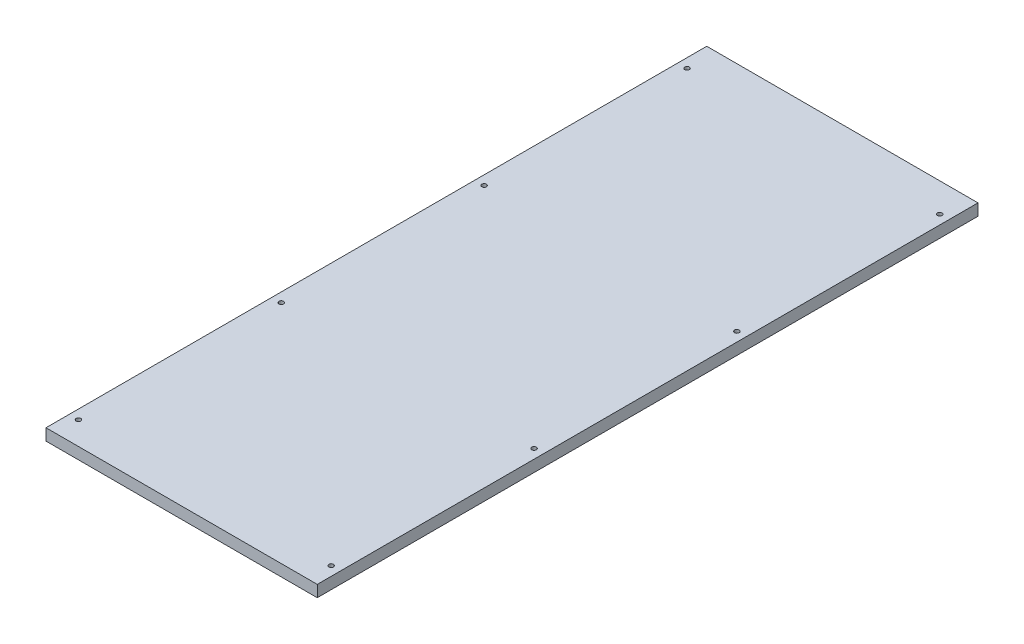
ISO-10303-21;
HEADER;
FILE_DESCRIPTION(('STEP AP214'),'2;1');
FILE_NAME('part.step','',(''),(''),'','','');
FILE_SCHEMA(('AUTOMOTIVE_DESIGN { 1 0 10303 214 1 1 1 1 }'));
ENDSEC;
DATA;
#1=APPLICATION_CONTEXT('core data for automotive mechanical design processes');
#2=APPLICATION_PROTOCOL_DEFINITION('international standard','automotive_design',2000,#1);
#3=PRODUCT_CONTEXT('',#1,'mechanical');
#4=PRODUCT('Part','Part','',(#3));
#5=PRODUCT_RELATED_PRODUCT_CATEGORY('part','',(#4));
#6=PRODUCT_DEFINITION_FORMATION('','',#4);
#7=PRODUCT_DEFINITION_CONTEXT('part definition',#1,'design');
#8=PRODUCT_DEFINITION('design','',#6,#7);
#9=PRODUCT_DEFINITION_SHAPE('','',#8);
#10=(LENGTH_UNIT() NAMED_UNIT(*) SI_UNIT(.MILLI.,.METRE.));
#11=(NAMED_UNIT(*) PLANE_ANGLE_UNIT() SI_UNIT($,.RADIAN.));
#12=(NAMED_UNIT(*) SI_UNIT($,.STERADIAN.) SOLID_ANGLE_UNIT());
#13=UNCERTAINTY_MEASURE_WITH_UNIT(LENGTH_MEASURE(1.E-05),#10,'distance_accuracy_value','');
#14=(GEOMETRIC_REPRESENTATION_CONTEXT(3) GLOBAL_UNCERTAINTY_ASSIGNED_CONTEXT((#13)) GLOBAL_UNIT_ASSIGNED_CONTEXT((#10,
#11,#12)) REPRESENTATION_CONTEXT('',''));
#15=CARTESIAN_POINT('',(0.,0.,0.));
#16=DIRECTION('',(0.,0.,1.));
#17=DIRECTION('',(1.,0.,0.));
#18=AXIS2_PLACEMENT_3D('',#15,#16,#17);
#19=CARTESIAN_POINT('',(0.,10.,0.));
#20=DIRECTION('',(0.,1.,0.));
#21=DIRECTION('',(0.,0.,1.));
#22=AXIS2_PLACEMENT_3D('',#19,#20,#21);
#23=PLANE('',#22);
#24=CARTESIAN_POINT('',(-109.000000000002,10.,-85.));
#25=DIRECTION('',(0.,1.,0.));
#26=DIRECTION('',(0.,0.,-1.));
#27=AXIS2_PLACEMENT_3D('',#24,#25,#26);
#28=CIRCLE('',#27,2.);
#29=CARTESIAN_POINT('',(-109.000000000002,10.,-87.));
#30=VERTEX_POINT('',#29);
#31=EDGE_CURVE('E145',#30,#30,#28,.T.);
#32=ORIENTED_EDGE('',*,*,#31,.F.);
#33=EDGE_LOOP('',(#32));
#34=FACE_BOUND('',#33,.T.);
#35=CARTESIAN_POINT('',(-109.000000000005,10.,265.));
#36=DIRECTION('',(0.,1.,0.));
#37=DIRECTION('',(0.,0.,-1.));
#38=AXIS2_PLACEMENT_3D('',#35,#36,#37);
#39=CIRCLE('',#38,2.);
#40=CARTESIAN_POINT('',(-109.000000000005,10.,263.));
#41=VERTEX_POINT('',#40);
#42=EDGE_CURVE('E133',#41,#41,#39,.T.);
#43=ORIENTED_EDGE('',*,*,#42,.F.);
#44=EDGE_LOOP('',(#43));
#45=FACE_BOUND('',#44,.T.);
#46=CARTESIAN_POINT('',(109.000000000004,10.,90.));
#47=DIRECTION('',(0.,1.,0.));
#48=DIRECTION('',(0.,0.,1.));
#49=AXIS2_PLACEMENT_3D('',#46,#47,#48);
#50=CIRCLE('',#49,2.);
#51=CARTESIAN_POINT('',(109.000000000004,10.,92.));
#52=VERTEX_POINT('',#51);
#53=EDGE_CURVE('E121',#52,#52,#50,.T.);
#54=ORIENTED_EDGE('',*,*,#53,.F.);
#55=EDGE_LOOP('',(#54));
#56=FACE_BOUND('',#55,.T.);
#57=CARTESIAN_POINT('',(109.,10.,-260.));
#58=DIRECTION('',(0.,1.,0.));
#59=DIRECTION('',(0.,0.,1.));
#60=AXIS2_PLACEMENT_3D('',#57,#58,#59);
#61=CIRCLE('',#60,2.);
#62=CARTESIAN_POINT('',(109.,10.,-258.));
#63=VERTEX_POINT('',#62);
#64=EDGE_CURVE('E100',#63,#63,#61,.T.);
#65=ORIENTED_EDGE('',*,*,#64,.F.);
#66=EDGE_LOOP('',(#65));
#67=FACE_BOUND('',#66,.T.);
#68=DIRECTION('',(0.,0.,1.));
#69=VECTOR('',#68,1.);
#70=CARTESIAN_POINT('',(-117.,10.,285.));
#71=LINE('',#70,#69);
#72=CARTESIAN_POINT('',(-117.,10.,-285.));
#73=VERTEX_POINT('',#72);
#74=CARTESIAN_POINT('',(-117.,10.,285.));
#75=VERTEX_POINT('',#74);
#76=EDGE_CURVE('E85',#73,#75,#71,.T.);
#77=ORIENTED_EDGE('',*,*,#76,.T.);
#78=DIRECTION('',(1.,0.,0.));
#79=VECTOR('',#78,1.);
#80=CARTESIAN_POINT('',(117.,10.,285.));
#81=LINE('',#80,#79);
#82=CARTESIAN_POINT('',(117.,10.,285.));
#83=VERTEX_POINT('',#82);
#84=EDGE_CURVE('E80',#75,#83,#81,.T.);
#85=ORIENTED_EDGE('',*,*,#84,.T.);
#86=DIRECTION('',(0.,0.,-1.));
#87=VECTOR('',#86,1.);
#88=CARTESIAN_POINT('',(117.,10.,285.));
#89=LINE('',#88,#87);
#90=CARTESIAN_POINT('',(117.,10.,-285.));
#91=VERTEX_POINT('',#90);
#92=EDGE_CURVE('E83',#83,#91,#89,.T.);
#93=ORIENTED_EDGE('',*,*,#92,.T.);
#94=DIRECTION('',(-1.,0.,0.));
#95=VECTOR('',#94,1.);
#96=CARTESIAN_POINT('',(117.,10.,-285.));
#97=LINE('',#96,#95);
#98=EDGE_CURVE('E50',#91,#73,#97,.T.);
#99=ORIENTED_EDGE('',*,*,#98,.T.);
#100=EDGE_LOOP('',(#77,#85,#93,#99));
#101=FACE_BOUND('',#100,.T.);
#102=CARTESIAN_POINT('',(109.000000000002,10.,-85.));
#103=DIRECTION('',(0.,1.,0.));
#104=DIRECTION('',(0.,0.,1.));
#105=AXIS2_PLACEMENT_3D('',#102,#103,#104);
#106=CIRCLE('',#105,2.);
#107=CARTESIAN_POINT('',(109.000000000002,10.,-83.));
#108=VERTEX_POINT('',#107);
#109=EDGE_CURVE('E115',#108,#108,#106,.T.);
#110=ORIENTED_EDGE('',*,*,#109,.F.);
#111=EDGE_LOOP('',(#110));
#112=FACE_BOUND('',#111,.T.);
#113=CARTESIAN_POINT('',(109.000000000005,10.,265.));
#114=DIRECTION('',(0.,1.,0.));
#115=DIRECTION('',(0.,0.,1.));
#116=AXIS2_PLACEMENT_3D('',#113,#114,#115);
#117=CIRCLE('',#116,2.);
#118=CARTESIAN_POINT('',(109.000000000005,10.,267.));
#119=VERTEX_POINT('',#118);
#120=EDGE_CURVE('E127',#119,#119,#117,.T.);
#121=ORIENTED_EDGE('',*,*,#120,.F.);
#122=EDGE_LOOP('',(#121));
#123=FACE_BOUND('',#122,.T.);
#124=CARTESIAN_POINT('',(-109.000000000004,10.,90.));
#125=DIRECTION('',(0.,1.,0.));
#126=DIRECTION('',(0.,0.,-1.));
#127=AXIS2_PLACEMENT_3D('',#124,#125,#126);
#128=CIRCLE('',#127,2.);
#129=CARTESIAN_POINT('',(-109.000000000004,10.,88.));
#130=VERTEX_POINT('',#129);
#131=EDGE_CURVE('E139',#130,#130,#128,.T.);
#132=ORIENTED_EDGE('',*,*,#131,.F.);
#133=EDGE_LOOP('',(#132));
#134=FACE_BOUND('',#133,.T.);
#135=CARTESIAN_POINT('',(-109.,10.,-260.));
#136=DIRECTION('',(0.,1.,0.));
#137=DIRECTION('',(0.,0.,-1.));
#138=AXIS2_PLACEMENT_3D('',#135,#136,#137);
#139=CIRCLE('',#138,2.);
#140=CARTESIAN_POINT('',(-109.,10.,-262.));
#141=VERTEX_POINT('',#140);
#142=EDGE_CURVE('E151',#141,#141,#139,.T.);
#143=ORIENTED_EDGE('',*,*,#142,.F.);
#144=EDGE_LOOP('',(#143));
#145=FACE_BOUND('',#144,.T.);
#146=ADVANCED_FACE('F33',(#34,#45,#56,#67,#101,#112,#123,#134,#145),#23,.T.);
#147=CARTESIAN_POINT('',(0.,0.,0.));
#148=DIRECTION('',(0.,1.,0.));
#149=DIRECTION('',(0.,0.,1.));
#150=AXIS2_PLACEMENT_3D('',#147,#148,#149);
#151=PLANE('',#150);
#152=DIRECTION('',(0.,0.,1.));
#153=VECTOR('',#152,1.);
#154=CARTESIAN_POINT('',(-117.,0.,285.));
#155=LINE('',#154,#153);
#156=CARTESIAN_POINT('',(-117.,0.,-285.));
#157=VERTEX_POINT('',#156);
#158=CARTESIAN_POINT('',(-117.,0.,285.));
#159=VERTEX_POINT('',#158);
#160=EDGE_CURVE('E97',#157,#159,#155,.T.);
#161=ORIENTED_EDGE('',*,*,#160,.F.);
#162=DIRECTION('',(-1.,0.,0.));
#163=VECTOR('',#162,1.);
#164=CARTESIAN_POINT('',(117.,0.,-285.));
#165=LINE('',#164,#163);
#166=CARTESIAN_POINT('',(117.,0.,-285.));
#167=VERTEX_POINT('',#166);
#168=EDGE_CURVE('E73',#167,#157,#165,.T.);
#169=ORIENTED_EDGE('',*,*,#168,.F.);
#170=DIRECTION('',(0.,0.,-1.));
#171=VECTOR('',#170,1.);
#172=CARTESIAN_POINT('',(117.,0.,285.));
#173=LINE('',#172,#171);
#174=CARTESIAN_POINT('',(117.,0.,285.));
#175=VERTEX_POINT('',#174);
#176=EDGE_CURVE('E67',#175,#167,#173,.T.);
#177=ORIENTED_EDGE('',*,*,#176,.F.);
#178=DIRECTION('',(1.,0.,0.));
#179=VECTOR('',#178,1.);
#180=CARTESIAN_POINT('',(117.,0.,285.));
#181=LINE('',#180,#179);
#182=EDGE_CURVE('E89',#159,#175,#181,.T.);
#183=ORIENTED_EDGE('',*,*,#182,.F.);
#184=EDGE_LOOP('',(#161,#169,#177,#183));
#185=FACE_BOUND('',#184,.T.);
#186=CARTESIAN_POINT('',(109.,0.,-260.));
#187=DIRECTION('',(0.,1.,0.));
#188=DIRECTION('',(0.,0.,1.));
#189=AXIS2_PLACEMENT_3D('',#186,#187,#188);
#190=CIRCLE('',#189,2.);
#191=CARTESIAN_POINT('',(109.,0.,-258.));
#192=VERTEX_POINT('',#191);
#193=EDGE_CURVE('E112',#192,#192,#190,.T.);
#194=ORIENTED_EDGE('',*,*,#193,.T.);
#195=EDGE_LOOP('',(#194));
#196=FACE_BOUND('',#195,.T.);
#197=CARTESIAN_POINT('',(109.000000000002,0.,-85.));
#198=DIRECTION('',(0.,1.,0.));
#199=DIRECTION('',(0.,0.,1.));
#200=AXIS2_PLACEMENT_3D('',#197,#198,#199);
#201=CIRCLE('',#200,2.);
#202=CARTESIAN_POINT('',(109.000000000002,0.,-83.));
#203=VERTEX_POINT('',#202);
#204=EDGE_CURVE('E118',#203,#203,#201,.T.);
#205=ORIENTED_EDGE('',*,*,#204,.T.);
#206=EDGE_LOOP('',(#205));
#207=FACE_BOUND('',#206,.T.);
#208=CARTESIAN_POINT('',(109.000000000004,0.,90.));
#209=DIRECTION('',(0.,1.,0.));
#210=DIRECTION('',(0.,0.,1.));
#211=AXIS2_PLACEMENT_3D('',#208,#209,#210);
#212=CIRCLE('',#211,2.);
#213=CARTESIAN_POINT('',(109.000000000004,0.,92.));
#214=VERTEX_POINT('',#213);
#215=EDGE_CURVE('E124',#214,#214,#212,.T.);
#216=ORIENTED_EDGE('',*,*,#215,.T.);
#217=EDGE_LOOP('',(#216));
#218=FACE_BOUND('',#217,.T.);
#219=CARTESIAN_POINT('',(109.000000000005,0.,265.));
#220=DIRECTION('',(0.,1.,0.));
#221=DIRECTION('',(0.,0.,1.));
#222=AXIS2_PLACEMENT_3D('',#219,#220,#221);
#223=CIRCLE('',#222,2.);
#224=CARTESIAN_POINT('',(109.000000000005,0.,267.));
#225=VERTEX_POINT('',#224);
#226=EDGE_CURVE('E130',#225,#225,#223,.T.);
#227=ORIENTED_EDGE('',*,*,#226,.T.);
#228=EDGE_LOOP('',(#227));
#229=FACE_BOUND('',#228,.T.);
#230=CARTESIAN_POINT('',(-109.000000000005,0.,265.));
#231=DIRECTION('',(0.,1.,0.));
#232=DIRECTION('',(0.,0.,-1.));
#233=AXIS2_PLACEMENT_3D('',#230,#231,#232);
#234=CIRCLE('',#233,2.);
#235=CARTESIAN_POINT('',(-109.000000000005,0.,263.));
#236=VERTEX_POINT('',#235);
#237=EDGE_CURVE('E136',#236,#236,#234,.T.);
#238=ORIENTED_EDGE('',*,*,#237,.T.);
#239=EDGE_LOOP('',(#238));
#240=FACE_BOUND('',#239,.T.);
#241=CARTESIAN_POINT('',(-109.000000000004,0.,90.));
#242=DIRECTION('',(0.,1.,0.));
#243=DIRECTION('',(0.,0.,-1.));
#244=AXIS2_PLACEMENT_3D('',#241,#242,#243);
#245=CIRCLE('',#244,2.);
#246=CARTESIAN_POINT('',(-109.000000000004,0.,88.));
#247=VERTEX_POINT('',#246);
#248=EDGE_CURVE('E142',#247,#247,#245,.T.);
#249=ORIENTED_EDGE('',*,*,#248,.T.);
#250=EDGE_LOOP('',(#249));
#251=FACE_BOUND('',#250,.T.);
#252=CARTESIAN_POINT('',(-109.000000000002,0.,-85.));
#253=DIRECTION('',(0.,1.,0.));
#254=DIRECTION('',(0.,0.,-1.));
#255=AXIS2_PLACEMENT_3D('',#252,#253,#254);
#256=CIRCLE('',#255,2.);
#257=CARTESIAN_POINT('',(-109.000000000002,0.,-87.));
#258=VERTEX_POINT('',#257);
#259=EDGE_CURVE('E148',#258,#258,#256,.T.);
#260=ORIENTED_EDGE('',*,*,#259,.T.);
#261=EDGE_LOOP('',(#260));
#262=FACE_BOUND('',#261,.T.);
#263=CARTESIAN_POINT('',(-109.,0.,-260.));
#264=DIRECTION('',(0.,1.,0.));
#265=DIRECTION('',(0.,0.,-1.));
#266=AXIS2_PLACEMENT_3D('',#263,#264,#265);
#267=CIRCLE('',#266,2.);
#268=CARTESIAN_POINT('',(-109.,0.,-262.));
#269=VERTEX_POINT('',#268);
#270=EDGE_CURVE('E154',#269,#269,#267,.T.);
#271=ORIENTED_EDGE('',*,*,#270,.T.);
#272=EDGE_LOOP('',(#271));
#273=FACE_BOUND('',#272,.T.);
#274=ADVANCED_FACE('F108',(#185,#196,#207,#218,#229,#240,#251,#262,#273),#151,.F.);
#275=CARTESIAN_POINT('',(-117.,10.,285.));
#276=DIRECTION('',(1.,0.,0.));
#277=DIRECTION('',(0.,0.,-1.));
#278=AXIS2_PLACEMENT_3D('',#275,#276,#277);
#279=PLANE('',#278);
#280=ORIENTED_EDGE('',*,*,#160,.T.);
#281=DIRECTION('',(0.,-1.,0.));
#282=VECTOR('',#281,1.);
#283=CARTESIAN_POINT('',(-117.,10.,285.));
#284=LINE('',#283,#282);
#285=EDGE_CURVE('E11',#75,#159,#284,.T.);
#286=ORIENTED_EDGE('',*,*,#285,.F.);
#287=ORIENTED_EDGE('',*,*,#76,.F.);
#288=DIRECTION('',(0.,-1.,0.));
#289=VECTOR('',#288,1.);
#290=CARTESIAN_POINT('',(-117.,10.,-285.));
#291=LINE('',#290,#289);
#292=EDGE_CURVE('E93',#73,#157,#291,.T.);
#293=ORIENTED_EDGE('',*,*,#292,.T.);
#294=EDGE_LOOP('',(#280,#286,#287,#293));
#295=FACE_BOUND('',#294,.T.);
#296=ADVANCED_FACE('F35',(#295),#279,.F.);
#297=CARTESIAN_POINT('',(117.,10.,285.));
#298=DIRECTION('',(0.,0.,-1.));
#299=DIRECTION('',(-1.,0.,0.));
#300=AXIS2_PLACEMENT_3D('',#297,#298,#299);
#301=PLANE('',#300);
#302=ORIENTED_EDGE('',*,*,#182,.T.);
#303=DIRECTION('',(0.,-1.,0.));
#304=VECTOR('',#303,1.);
#305=CARTESIAN_POINT('',(117.,10.,285.));
#306=LINE('',#305,#304);
#307=EDGE_CURVE('E42',#83,#175,#306,.T.);
#308=ORIENTED_EDGE('',*,*,#307,.F.);
#309=ORIENTED_EDGE('',*,*,#84,.F.);
#310=ORIENTED_EDGE('',*,*,#285,.T.);
#311=EDGE_LOOP('',(#302,#308,#309,#310));
#312=FACE_BOUND('',#311,.T.);
#313=ADVANCED_FACE('F88',(#312),#301,.F.);
#314=CARTESIAN_POINT('',(117.,10.,285.));
#315=DIRECTION('',(-1.,0.,0.));
#316=DIRECTION('',(0.,0.,1.));
#317=AXIS2_PLACEMENT_3D('',#314,#315,#316);
#318=PLANE('',#317);
#319=ORIENTED_EDGE('',*,*,#176,.T.);
#320=DIRECTION('',(0.,-1.,0.));
#321=VECTOR('',#320,1.);
#322=CARTESIAN_POINT('',(117.,10.,-285.));
#323=LINE('',#322,#321);
#324=EDGE_CURVE('E90',#91,#167,#323,.T.);
#325=ORIENTED_EDGE('',*,*,#324,.F.);
#326=ORIENTED_EDGE('',*,*,#92,.F.);
#327=ORIENTED_EDGE('',*,*,#307,.T.);
#328=EDGE_LOOP('',(#319,#325,#326,#327));
#329=FACE_BOUND('',#328,.T.);
#330=ADVANCED_FACE('F91',(#329),#318,.F.);
#331=CARTESIAN_POINT('',(117.,10.,-285.));
#332=DIRECTION('',(0.,0.,1.));
#333=DIRECTION('',(1.,0.,0.));
#334=AXIS2_PLACEMENT_3D('',#331,#332,#333);
#335=PLANE('',#334);
#336=ORIENTED_EDGE('',*,*,#168,.T.);
#337=ORIENTED_EDGE('',*,*,#292,.F.);
#338=ORIENTED_EDGE('',*,*,#98,.F.);
#339=ORIENTED_EDGE('',*,*,#324,.T.);
#340=EDGE_LOOP('',(#336,#337,#338,#339));
#341=FACE_BOUND('',#340,.T.);
#342=ADVANCED_FACE('F105',(#341),#335,.F.);
#343=CARTESIAN_POINT('',(109.,10.,-260.));
#344=DIRECTION('',(0.,-1.,0.));
#345=DIRECTION('',(0.,0.,-1.));
#346=AXIS2_PLACEMENT_3D('',#343,#344,#345);
#347=CYLINDRICAL_SURFACE('',#346,2.);
#348=ORIENTED_EDGE('',*,*,#64,.T.);
#349=EDGE_LOOP('',(#348));
#350=FACE_BOUND('',#349,.T.);
#351=ORIENTED_EDGE('',*,*,#193,.F.);
#352=EDGE_LOOP('',(#351));
#353=FACE_BOUND('',#352,.T.);
#354=ADVANCED_FACE('F173',(#350,#353),#347,.F.);
#355=CARTESIAN_POINT('',(109.000000000002,10.,-85.));
#356=DIRECTION('',(0.,-1.,0.));
#357=DIRECTION('',(0.,0.,-1.));
#358=AXIS2_PLACEMENT_3D('',#355,#356,#357);
#359=CYLINDRICAL_SURFACE('',#358,2.);
#360=ORIENTED_EDGE('',*,*,#109,.T.);
#361=EDGE_LOOP('',(#360));
#362=FACE_BOUND('',#361,.T.);
#363=ORIENTED_EDGE('',*,*,#204,.F.);
#364=EDGE_LOOP('',(#363));
#365=FACE_BOUND('',#364,.T.);
#366=ADVANCED_FACE('F219',(#362,#365),#359,.F.);
#367=CARTESIAN_POINT('',(109.000000000004,10.,90.));
#368=DIRECTION('',(0.,-1.,0.));
#369=DIRECTION('',(0.,0.,-1.));
#370=AXIS2_PLACEMENT_3D('',#367,#368,#369);
#371=CYLINDRICAL_SURFACE('',#370,2.);
#372=ORIENTED_EDGE('',*,*,#53,.T.);
#373=EDGE_LOOP('',(#372));
#374=FACE_BOUND('',#373,.T.);
#375=ORIENTED_EDGE('',*,*,#215,.F.);
#376=EDGE_LOOP('',(#375));
#377=FACE_BOUND('',#376,.T.);
#378=ADVANCED_FACE('F227',(#374,#377),#371,.F.);
#379=CARTESIAN_POINT('',(109.000000000005,10.,265.));
#380=DIRECTION('',(0.,-1.,0.));
#381=DIRECTION('',(0.,0.,-1.));
#382=AXIS2_PLACEMENT_3D('',#379,#380,#381);
#383=CYLINDRICAL_SURFACE('',#382,2.);
#384=ORIENTED_EDGE('',*,*,#120,.T.);
#385=EDGE_LOOP('',(#384));
#386=FACE_BOUND('',#385,.T.);
#387=ORIENTED_EDGE('',*,*,#226,.F.);
#388=EDGE_LOOP('',(#387));
#389=FACE_BOUND('',#388,.T.);
#390=ADVANCED_FACE('F235',(#386,#389),#383,.F.);
#391=CARTESIAN_POINT('',(-109.000000000005,10.,265.));
#392=DIRECTION('',(0.,-1.,0.));
#393=DIRECTION('',(0.,0.,-1.));
#394=AXIS2_PLACEMENT_3D('',#391,#392,#393);
#395=CYLINDRICAL_SURFACE('',#394,2.);
#396=ORIENTED_EDGE('',*,*,#42,.T.);
#397=EDGE_LOOP('',(#396));
#398=FACE_BOUND('',#397,.T.);
#399=ORIENTED_EDGE('',*,*,#237,.F.);
#400=EDGE_LOOP('',(#399));
#401=FACE_BOUND('',#400,.T.);
#402=ADVANCED_FACE('F244',(#398,#401),#395,.F.);
#403=CARTESIAN_POINT('',(-109.000000000004,10.,90.));
#404=DIRECTION('',(0.,-1.,0.));
#405=DIRECTION('',(0.,0.,-1.));
#406=AXIS2_PLACEMENT_3D('',#403,#404,#405);
#407=CYLINDRICAL_SURFACE('',#406,2.);
#408=ORIENTED_EDGE('',*,*,#131,.T.);
#409=EDGE_LOOP('',(#408));
#410=FACE_BOUND('',#409,.T.);
#411=ORIENTED_EDGE('',*,*,#248,.F.);
#412=EDGE_LOOP('',(#411));
#413=FACE_BOUND('',#412,.T.);
#414=ADVANCED_FACE('F253',(#410,#413),#407,.F.);
#415=CARTESIAN_POINT('',(-109.000000000002,10.,-85.));
#416=DIRECTION('',(0.,-1.,0.));
#417=DIRECTION('',(0.,0.,-1.));
#418=AXIS2_PLACEMENT_3D('',#415,#416,#417);
#419=CYLINDRICAL_SURFACE('',#418,2.);
#420=ORIENTED_EDGE('',*,*,#31,.T.);
#421=EDGE_LOOP('',(#420));
#422=FACE_BOUND('',#421,.T.);
#423=ORIENTED_EDGE('',*,*,#259,.F.);
#424=EDGE_LOOP('',(#423));
#425=FACE_BOUND('',#424,.T.);
#426=ADVANCED_FACE('F262',(#422,#425),#419,.F.);
#427=CARTESIAN_POINT('',(-109.,10.,-260.));
#428=DIRECTION('',(0.,-1.,0.));
#429=DIRECTION('',(0.,0.,-1.));
#430=AXIS2_PLACEMENT_3D('',#427,#428,#429);
#431=CYLINDRICAL_SURFACE('',#430,2.);
#432=ORIENTED_EDGE('',*,*,#142,.T.);
#433=EDGE_LOOP('',(#432));
#434=FACE_BOUND('',#433,.T.);
#435=ORIENTED_EDGE('',*,*,#270,.F.);
#436=EDGE_LOOP('',(#435));
#437=FACE_BOUND('',#436,.T.);
#438=ADVANCED_FACE('F160',(#434,#437),#431,.F.);
#439=CLOSED_SHELL('',(#146,#274,#296,#313,#330,#342,#354,#366,#378,#390,#402,#414,#426,#438));
#440=MANIFOLD_SOLID_BREP('B2',#439);
#441=ADVANCED_BREP_SHAPE_REPRESENTATION('',(#18,#440),#14);
#442=SHAPE_DEFINITION_REPRESENTATION(#9,#441);
ENDSEC;
END-ISO-10303-21;
